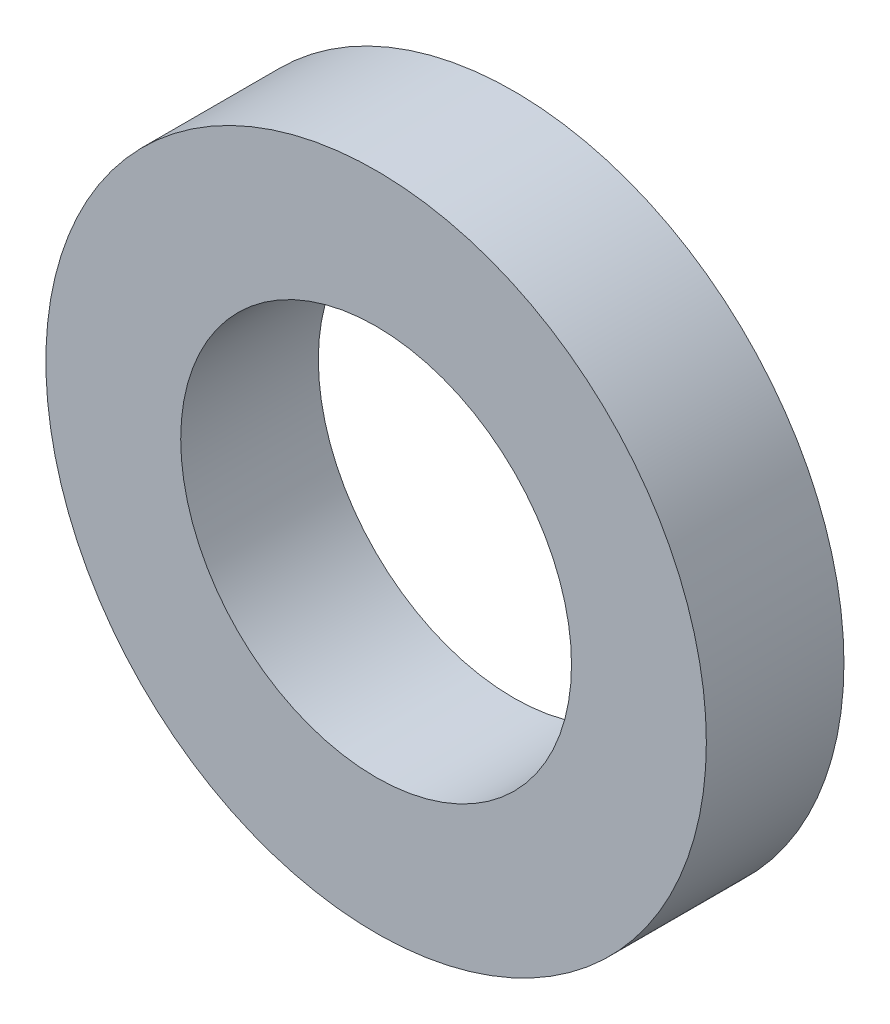
ISO-10303-21;
HEADER;
FILE_DESCRIPTION(('STEP AP214'),'2;1');
FILE_NAME('part.step','',(''),(''),'','','');
FILE_SCHEMA(('AUTOMOTIVE_DESIGN { 1 0 10303 214 1 1 1 1 }'));
ENDSEC;
DATA;
#1=APPLICATION_CONTEXT('core data for automotive mechanical design processes');
#2=APPLICATION_PROTOCOL_DEFINITION('international standard','automotive_design',2000,#1);
#3=PRODUCT_CONTEXT('',#1,'mechanical');
#4=PRODUCT('Part','Part','',(#3));
#5=PRODUCT_RELATED_PRODUCT_CATEGORY('part','',(#4));
#6=PRODUCT_DEFINITION_FORMATION('','',#4);
#7=PRODUCT_DEFINITION_CONTEXT('part definition',#1,'design');
#8=PRODUCT_DEFINITION('design','',#6,#7);
#9=PRODUCT_DEFINITION_SHAPE('','',#8);
#10=(LENGTH_UNIT() NAMED_UNIT(*) SI_UNIT(.MILLI.,.METRE.));
#11=(NAMED_UNIT(*) PLANE_ANGLE_UNIT() SI_UNIT($,.RADIAN.));
#12=(NAMED_UNIT(*) SI_UNIT($,.STERADIAN.) SOLID_ANGLE_UNIT());
#13=UNCERTAINTY_MEASURE_WITH_UNIT(LENGTH_MEASURE(1.E-05),#10,'distance_accuracy_value','');
#14=(GEOMETRIC_REPRESENTATION_CONTEXT(3) GLOBAL_UNCERTAINTY_ASSIGNED_CONTEXT((#13)) GLOBAL_UNIT_ASSIGNED_CONTEXT((#10,
#11,#12)) REPRESENTATION_CONTEXT('',''));
#15=CARTESIAN_POINT('',(0.,0.,0.));
#16=DIRECTION('',(0.,0.,1.));
#17=DIRECTION('',(1.,0.,0.));
#18=AXIS2_PLACEMENT_3D('',#15,#16,#17);
#19=CARTESIAN_POINT('',(0.,0.,2.5));
#20=DIRECTION('',(0.,0.,1.));
#21=DIRECTION('',(1.,0.,0.));
#22=AXIS2_PLACEMENT_3D('',#19,#20,#21);
#23=PLANE('',#22);
#24=CARTESIAN_POINT('',(0.,0.,2.5));
#25=DIRECTION('',(0.,0.,1.));
#26=DIRECTION('',(1.,0.,0.));
#27=AXIS2_PLACEMENT_3D('',#24,#25,#26);
#28=CIRCLE('',#27,6.);
#29=CARTESIAN_POINT('',(6.,0.,2.5));
#30=VERTEX_POINT('',#29);
#31=EDGE_CURVE('E10',#30,#30,#28,.T.);
#32=ORIENTED_EDGE('',*,*,#31,.T.);
#33=EDGE_LOOP('',(#32));
#34=FACE_BOUND('',#33,.T.);
#35=CARTESIAN_POINT('',(0.,0.,2.5));
#36=DIRECTION('',(0.,0.,1.));
#37=DIRECTION('',(1.,0.,0.));
#38=AXIS2_PLACEMENT_3D('',#35,#36,#37);
#39=CIRCLE('',#38,3.55);
#40=CARTESIAN_POINT('',(3.55,0.,2.5));
#41=VERTEX_POINT('',#40);
#42=EDGE_CURVE('E41',#41,#41,#39,.T.);
#43=ORIENTED_EDGE('',*,*,#42,.F.);
#44=EDGE_LOOP('',(#43));
#45=FACE_BOUND('',#44,.T.);
#46=ADVANCED_FACE('F30',(#34,#45),#23,.T.);
#47=CARTESIAN_POINT('',(0.,0.,0.));
#48=DIRECTION('',(0.,0.,1.));
#49=DIRECTION('',(1.,0.,0.));
#50=AXIS2_PLACEMENT_3D('',#47,#48,#49);
#51=PLANE('',#50);
#52=CARTESIAN_POINT('',(0.,0.,0.));
#53=DIRECTION('',(0.,0.,1.));
#54=DIRECTION('',(1.,0.,0.));
#55=AXIS2_PLACEMENT_3D('',#52,#53,#54);
#56=CIRCLE('',#55,6.);
#57=CARTESIAN_POINT('',(6.,0.,0.));
#58=VERTEX_POINT('',#57);
#59=EDGE_CURVE('E34',#58,#58,#56,.T.);
#60=ORIENTED_EDGE('',*,*,#59,.F.);
#61=EDGE_LOOP('',(#60));
#62=FACE_BOUND('',#61,.T.);
#63=CARTESIAN_POINT('',(0.,0.,0.));
#64=DIRECTION('',(0.,0.,1.));
#65=DIRECTION('',(1.,0.,0.));
#66=AXIS2_PLACEMENT_3D('',#63,#64,#65);
#67=CIRCLE('',#66,3.55);
#68=CARTESIAN_POINT('',(3.55,0.,0.));
#69=VERTEX_POINT('',#68);
#70=EDGE_CURVE('E43',#69,#69,#67,.T.);
#71=ORIENTED_EDGE('',*,*,#70,.T.);
#72=EDGE_LOOP('',(#71));
#73=FACE_BOUND('',#72,.T.);
#74=ADVANCED_FACE('F53',(#62,#73),#51,.F.);
#75=CARTESIAN_POINT('',(0.,0.,2.5));
#76=DIRECTION('',(0.,0.,-1.));
#77=DIRECTION('',(-1.,0.,0.));
#78=AXIS2_PLACEMENT_3D('',#75,#76,#77);
#79=CYLINDRICAL_SURFACE('',#78,6.);
#80=ORIENTED_EDGE('',*,*,#31,.F.);
#81=EDGE_LOOP('',(#80));
#82=FACE_BOUND('',#81,.T.);
#83=ORIENTED_EDGE('',*,*,#59,.T.);
#84=EDGE_LOOP('',(#83));
#85=FACE_BOUND('',#84,.T.);
#86=ADVANCED_FACE('F32',(#82,#85),#79,.T.);
#87=CARTESIAN_POINT('',(0.,0.,2.5));
#88=DIRECTION('',(0.,0.,-1.));
#89=DIRECTION('',(-1.,0.,0.));
#90=AXIS2_PLACEMENT_3D('',#87,#88,#89);
#91=CYLINDRICAL_SURFACE('',#90,3.55);
#92=ORIENTED_EDGE('',*,*,#42,.T.);
#93=EDGE_LOOP('',(#92));
#94=FACE_BOUND('',#93,.T.);
#95=ORIENTED_EDGE('',*,*,#70,.F.);
#96=EDGE_LOOP('',(#95));
#97=FACE_BOUND('',#96,.T.);
#98=ADVANCED_FACE('F49',(#94,#97),#91,.F.);
#99=CLOSED_SHELL('',(#46,#74,#86,#98));
#100=MANIFOLD_SOLID_BREP('B2',#99);
#101=ADVANCED_BREP_SHAPE_REPRESENTATION('',(#18,#100),#14);
#102=SHAPE_DEFINITION_REPRESENTATION(#9,#101);
ENDSEC;
END-ISO-10303-21;
